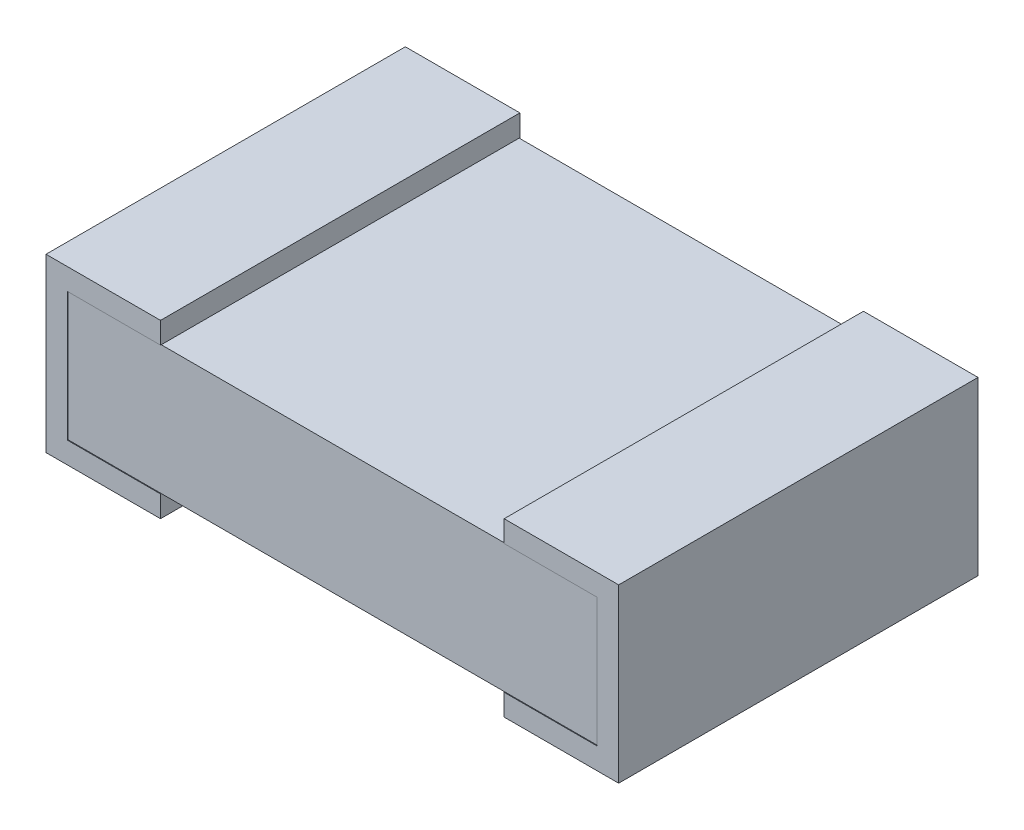
ISO-10303-21;
HEADER;
FILE_DESCRIPTION(('STEP AP214'),'2;1');
FILE_NAME('part.step','',(''),(''),'','','');
FILE_SCHEMA(('AUTOMOTIVE_DESIGN { 1 0 10303 214 1 1 1 1 }'));
ENDSEC;
DATA;
#1=APPLICATION_CONTEXT('core data for automotive mechanical design processes');
#2=APPLICATION_PROTOCOL_DEFINITION('international standard','automotive_design',2000,#1);
#3=PRODUCT_CONTEXT('',#1,'mechanical');
#4=PRODUCT('Part','Part','',(#3));
#5=PRODUCT_RELATED_PRODUCT_CATEGORY('part','',(#4));
#6=PRODUCT_DEFINITION_FORMATION('','',#4);
#7=PRODUCT_DEFINITION_CONTEXT('part definition',#1,'design');
#8=PRODUCT_DEFINITION('design','',#6,#7);
#9=PRODUCT_DEFINITION_SHAPE('','',#8);
#10=(LENGTH_UNIT() NAMED_UNIT(*) SI_UNIT(.MILLI.,.METRE.));
#11=(NAMED_UNIT(*) PLANE_ANGLE_UNIT() SI_UNIT($,.RADIAN.));
#12=(NAMED_UNIT(*) SI_UNIT($,.STERADIAN.) SOLID_ANGLE_UNIT());
#13=UNCERTAINTY_MEASURE_WITH_UNIT(LENGTH_MEASURE(1.E-05),#10,'distance_accuracy_value','');
#14=(GEOMETRIC_REPRESENTATION_CONTEXT(3) GLOBAL_UNCERTAINTY_ASSIGNED_CONTEXT((#13)) GLOBAL_UNIT_ASSIGNED_CONTEXT((#10,
#11,#12)) REPRESENTATION_CONTEXT('',''));
#15=CARTESIAN_POINT('',(0.,0.,0.));
#16=DIRECTION('',(0.,0.,1.));
#17=DIRECTION('',(1.,0.,0.));
#18=AXIS2_PLACEMENT_3D('',#15,#16,#17);
#19=CARTESIAN_POINT('',(1.9558,0.0762000000000002,-0.635));
#20=DIRECTION('',(0.,-1.,0.));
#21=DIRECTION('',(1.,0.,0.));
#22=AXIS2_PLACEMENT_3D('',#19,#20,#21);
#23=PLANE('',#22);
#24=DIRECTION('',(1.,0.,0.));
#25=VECTOR('',#24,1.);
#26=CARTESIAN_POINT('',(1.9558,0.0762000000000002,-0.635));
#27=LINE('',#26,#25);
#28=CARTESIAN_POINT('',(0.4064,0.0762000000000001,-0.635));
#29=VERTEX_POINT('',#28);
#30=CARTESIAN_POINT('',(1.6256,0.0762000000000001,-0.635));
#31=VERTEX_POINT('',#30);
#32=EDGE_CURVE('E43',#29,#31,#27,.T.);
#33=ORIENTED_EDGE('',*,*,#32,.T.);
#34=DIRECTION('',(0.,0.,-1.));
#35=VECTOR('',#34,1.);
#36=CARTESIAN_POINT('',(1.6256,0.0762000000000001,0.63754));
#37=LINE('',#36,#35);
#38=CARTESIAN_POINT('',(1.6256,0.0762000000000001,0.635));
#39=VERTEX_POINT('',#38);
#40=EDGE_CURVE('E274',#39,#31,#37,.T.);
#41=ORIENTED_EDGE('',*,*,#40,.F.);
#42=DIRECTION('',(1.,0.,0.));
#43=VECTOR('',#42,1.);
#44=CARTESIAN_POINT('',(1.9558,0.0762000000000002,0.635));
#45=LINE('',#44,#43);
#46=CARTESIAN_POINT('',(0.4064,0.0762000000000001,0.635));
#47=VERTEX_POINT('',#46);
#48=EDGE_CURVE('E373',#47,#39,#45,.T.);
#49=ORIENTED_EDGE('',*,*,#48,.F.);
#50=DIRECTION('',(0.,0.,-1.));
#51=VECTOR('',#50,1.);
#52=CARTESIAN_POINT('',(0.4064,0.0762000000000001,0.63754));
#53=LINE('',#52,#51);
#54=EDGE_CURVE('E335',#47,#29,#53,.T.);
#55=ORIENTED_EDGE('',*,*,#54,.T.);
#56=EDGE_LOOP('',(#33,#41,#49,#55));
#57=FACE_BOUND('',#56,.T.);
#58=ADVANCED_FACE('F34',(#57),#23,.T.);
#59=CARTESIAN_POINT('',(0.0762,0.5334,-0.635));
#60=DIRECTION('',(0.,1.,0.));
#61=DIRECTION('',(-1.,0.,0.));
#62=AXIS2_PLACEMENT_3D('',#59,#60,#61);
#63=PLANE('',#62);
#64=DIRECTION('',(-1.,0.,0.));
#65=VECTOR('',#64,1.);
#66=CARTESIAN_POINT('',(0.0762,0.5334,0.635));
#67=LINE('',#66,#65);
#68=CARTESIAN_POINT('',(1.6256,0.5334,0.635));
#69=VERTEX_POINT('',#68);
#70=CARTESIAN_POINT('',(0.4064,0.5334,0.635));
#71=VERTEX_POINT('',#70);
#72=EDGE_CURVE('E366',#69,#71,#67,.T.);
#73=ORIENTED_EDGE('',*,*,#72,.F.);
#74=DIRECTION('',(0.,0.,-1.));
#75=VECTOR('',#74,1.);
#76=CARTESIAN_POINT('',(1.6256,0.5334,0.63754));
#77=LINE('',#76,#75);
#78=CARTESIAN_POINT('',(1.6256,0.5334,-0.635));
#79=VERTEX_POINT('',#78);
#80=EDGE_CURVE('E263',#69,#79,#77,.T.);
#81=ORIENTED_EDGE('',*,*,#80,.T.);
#82=DIRECTION('',(-1.,0.,0.));
#83=VECTOR('',#82,1.);
#84=CARTESIAN_POINT('',(0.0762,0.5334,-0.635));
#85=LINE('',#84,#83);
#86=CARTESIAN_POINT('',(0.4064,0.5334,-0.635));
#87=VERTEX_POINT('',#86);
#88=EDGE_CURVE('E355',#79,#87,#85,.T.);
#89=ORIENTED_EDGE('',*,*,#88,.T.);
#90=DIRECTION('',(0.,0.,-1.));
#91=VECTOR('',#90,1.);
#92=CARTESIAN_POINT('',(0.4064,0.5334,0.63754));
#93=LINE('',#92,#91);
#94=EDGE_CURVE('E346',#71,#87,#93,.T.);
#95=ORIENTED_EDGE('',*,*,#94,.F.);
#96=EDGE_LOOP('',(#73,#81,#89,#95));
#97=FACE_BOUND('',#96,.T.);
#98=ADVANCED_FACE('F36',(#97),#63,.T.);
#99=CARTESIAN_POINT('',(1.9558,0.5334,-0.635));
#100=DIRECTION('',(0.,0.,-1.));
#101=DIRECTION('',(-1.,0.,0.));
#102=AXIS2_PLACEMENT_3D('',#99,#100,#101);
#103=PLANE('',#102);
#104=DIRECTION('',(0.,1.,0.));
#105=VECTOR('',#104,1.);
#106=CARTESIAN_POINT('',(1.9558,0.0762000000000002,-0.635));
#107=LINE('',#106,#105);
#108=CARTESIAN_POINT('',(1.9558,0.0762,-0.635));
#109=VERTEX_POINT('',#108);
#110=CARTESIAN_POINT('',(1.9558,0.5334,-0.635));
#111=VERTEX_POINT('',#110);
#112=EDGE_CURVE('E353',#109,#111,#107,.T.);
#113=ORIENTED_EDGE('',*,*,#112,.F.);
#114=DIRECTION('',(-1.,0.,0.));
#115=VECTOR('',#114,1.);
#116=CARTESIAN_POINT('',(1.9558,0.0762,-0.635));
#117=LINE('',#116,#115);
#118=EDGE_CURVE('E256',#109,#31,#117,.T.);
#119=ORIENTED_EDGE('',*,*,#118,.T.);
#120=ORIENTED_EDGE('',*,*,#32,.F.);
#121=CARTESIAN_POINT('',(0.0762,0.0762,-0.635));
#122=VERTEX_POINT('',#121);
#123=EDGE_CURVE('E11',#122,#29,#27,.T.);
#124=ORIENTED_EDGE('',*,*,#123,.F.);
#125=DIRECTION('',(0.,-1.,0.));
#126=VECTOR('',#125,1.);
#127=CARTESIAN_POINT('',(0.0762,0.5334,-0.635));
#128=LINE('',#127,#126);
#129=CARTESIAN_POINT('',(0.0762,0.5334,-0.635));
#130=VERTEX_POINT('',#129);
#131=EDGE_CURVE('E358',#130,#122,#128,.T.);
#132=ORIENTED_EDGE('',*,*,#131,.F.);
#133=DIRECTION('',(-1.,0.,0.));
#134=VECTOR('',#133,1.);
#135=CARTESIAN_POINT('',(1.9558,0.5334,-0.635));
#136=LINE('',#135,#134);
#137=EDGE_CURVE('E329',#87,#130,#136,.T.);
#138=ORIENTED_EDGE('',*,*,#137,.F.);
#139=ORIENTED_EDGE('',*,*,#88,.F.);
#140=EDGE_CURVE('E356',#111,#79,#85,.T.);
#141=ORIENTED_EDGE('',*,*,#140,.F.);
#142=EDGE_LOOP('',(#113,#119,#120,#124,#132,#138,#139,#141));
#143=FACE_BOUND('',#142,.T.);
#144=ADVANCED_FACE('F437',(#143),#103,.T.);
#145=CARTESIAN_POINT('',(1.9558,0.5334,0.635));
#146=DIRECTION('',(0.,0.,-1.));
#147=DIRECTION('',(-1.,0.,0.));
#148=AXIS2_PLACEMENT_3D('',#145,#146,#147);
#149=PLANE('',#148);
#150=DIRECTION('',(0.,1.,0.));
#151=VECTOR('',#150,1.);
#152=CARTESIAN_POINT('',(1.9558,0.0762000000000002,0.635));
#153=LINE('',#152,#151);
#154=CARTESIAN_POINT('',(1.9558,0.0762000000000002,0.635));
#155=VERTEX_POINT('',#154);
#156=CARTESIAN_POINT('',(1.9558,0.5334,0.635));
#157=VERTEX_POINT('',#156);
#158=EDGE_CURVE('E352',#155,#157,#153,.T.);
#159=ORIENTED_EDGE('',*,*,#158,.T.);
#160=EDGE_CURVE('E363',#157,#69,#67,.T.);
#161=ORIENTED_EDGE('',*,*,#160,.T.);
#162=ORIENTED_EDGE('',*,*,#72,.T.);
#163=CARTESIAN_POINT('',(0.0762,0.5334,0.635));
#164=VERTEX_POINT('',#163);
#165=EDGE_CURVE('E362',#71,#164,#67,.T.);
#166=ORIENTED_EDGE('',*,*,#165,.T.);
#167=DIRECTION('',(0.,-1.,0.));
#168=VECTOR('',#167,1.);
#169=CARTESIAN_POINT('',(0.0762,0.5334,0.635));
#170=LINE('',#169,#168);
#171=CARTESIAN_POINT('',(0.0762,0.0762,0.635));
#172=VERTEX_POINT('',#171);
#173=EDGE_CURVE('E365',#164,#172,#170,.T.);
#174=ORIENTED_EDGE('',*,*,#173,.T.);
#175=EDGE_CURVE('E38',#172,#47,#45,.T.);
#176=ORIENTED_EDGE('',*,*,#175,.T.);
#177=ORIENTED_EDGE('',*,*,#48,.T.);
#178=EDGE_CURVE('E368',#39,#155,#45,.T.);
#179=ORIENTED_EDGE('',*,*,#178,.T.);
#180=EDGE_LOOP('',(#159,#161,#162,#166,#174,#176,#177,#179));
#181=FACE_BOUND('',#180,.T.);
#182=ADVANCED_FACE('F375',(#181),#149,.F.);
#183=CARTESIAN_POINT('',(0.0762,0.0762,0.63754));
#184=DIRECTION('',(0.,1.,0.));
#185=DIRECTION('',(-1.,0.,0.));
#186=AXIS2_PLACEMENT_3D('',#183,#184,#185);
#187=PLANE('',#186);
#188=ORIENTED_EDGE('',*,*,#175,.F.);
#189=DIRECTION('',(0.,0.,-1.));
#190=VECTOR('',#189,1.);
#191=CARTESIAN_POINT('',(0.0762,0.0762,0.63754));
#192=LINE('',#191,#190);
#193=CARTESIAN_POINT('',(0.0762,0.0762,0.63754));
#194=VERTEX_POINT('',#193);
#195=EDGE_CURVE('E337',#194,#172,#192,.T.);
#196=ORIENTED_EDGE('',*,*,#195,.F.);
#197=DIRECTION('',(1.,0.,0.));
#198=VECTOR('',#197,1.);
#199=CARTESIAN_POINT('',(0.0762,0.0762,0.63754));
#200=LINE('',#199,#198);
#201=CARTESIAN_POINT('',(0.4064,0.0762000000000001,0.63754));
#202=VERTEX_POINT('',#201);
#203=EDGE_CURVE('E295',#194,#202,#200,.T.);
#204=ORIENTED_EDGE('',*,*,#203,.T.);
#205=EDGE_CURVE('E332',#202,#47,#53,.T.);
#206=ORIENTED_EDGE('',*,*,#205,.T.);
#207=EDGE_LOOP('',(#188,#196,#204,#206));
#208=FACE_BOUND('',#207,.T.);
#209=ADVANCED_FACE('F378',(#208),#187,.T.);
#210=CARTESIAN_POINT('',(0.0762,0.5334,0.63754));
#211=DIRECTION('',(1.,0.,0.));
#212=DIRECTION('',(0.,0.,-1.));
#213=AXIS2_PLACEMENT_3D('',#210,#211,#212);
#214=PLANE('',#213);
#215=ORIENTED_EDGE('',*,*,#173,.F.);
#216=DIRECTION('',(0.,0.,-1.));
#217=VECTOR('',#216,1.);
#218=CARTESIAN_POINT('',(0.0762,0.5334,0.63754));
#219=LINE('',#218,#217);
#220=CARTESIAN_POINT('',(0.0762,0.5334,0.63754));
#221=VERTEX_POINT('',#220);
#222=EDGE_CURVE('E59',#221,#164,#219,.T.);
#223=ORIENTED_EDGE('',*,*,#222,.F.);
#224=DIRECTION('',(0.,-1.,0.));
#225=VECTOR('',#224,1.);
#226=CARTESIAN_POINT('',(0.0762,0.5334,0.63754));
#227=LINE('',#226,#225);
#228=EDGE_CURVE('E292',#221,#194,#227,.T.);
#229=ORIENTED_EDGE('',*,*,#228,.T.);
#230=ORIENTED_EDGE('',*,*,#195,.T.);
#231=EDGE_LOOP('',(#215,#223,#229,#230));
#232=FACE_BOUND('',#231,.T.);
#233=ADVANCED_FACE('F381',(#232),#214,.T.);
#234=CARTESIAN_POINT('',(0.4064,0.5334,0.63754));
#235=DIRECTION('',(0.,-1.,0.));
#236=DIRECTION('',(0.,0.,-1.));
#237=AXIS2_PLACEMENT_3D('',#234,#235,#236);
#238=PLANE('',#237);
#239=ORIENTED_EDGE('',*,*,#165,.F.);
#240=CARTESIAN_POINT('',(0.4064,0.5334,0.63754));
#241=VERTEX_POINT('',#240);
#242=EDGE_CURVE('E343',#241,#71,#93,.T.);
#243=ORIENTED_EDGE('',*,*,#242,.F.);
#244=DIRECTION('',(-1.,0.,0.));
#245=VECTOR('',#244,1.);
#246=CARTESIAN_POINT('',(0.4064,0.5334,0.63754));
#247=LINE('',#246,#245);
#248=EDGE_CURVE('E290',#241,#221,#247,.T.);
#249=ORIENTED_EDGE('',*,*,#248,.T.);
#250=ORIENTED_EDGE('',*,*,#222,.T.);
#251=EDGE_LOOP('',(#239,#243,#249,#250));
#252=FACE_BOUND('',#251,.T.);
#253=ADVANCED_FACE('F389',(#252),#238,.T.);
#254=CARTESIAN_POINT('',(0.,0.,0.63754));
#255=DIRECTION('',(-1.,0.,0.));
#256=DIRECTION('',(0.,0.,1.));
#257=AXIS2_PLACEMENT_3D('',#254,#255,#256);
#258=PLANE('',#257);
#259=DIRECTION('',(0.,1.,0.));
#260=VECTOR('',#259,1.);
#261=CARTESIAN_POINT('',(0.,0.,-0.63754));
#262=LINE('',#261,#260);
#263=CARTESIAN_POINT('',(0.,0.,-0.63754));
#264=VERTEX_POINT('',#263);
#265=CARTESIAN_POINT('',(0.,0.6096,-0.63754));
#266=VERTEX_POINT('',#265);
#267=EDGE_CURVE('E279',#264,#266,#262,.T.);
#268=ORIENTED_EDGE('',*,*,#267,.F.);
#269=DIRECTION('',(0.,0.,-1.));
#270=VECTOR('',#269,1.);
#271=CARTESIAN_POINT('',(0.,0.,0.63754));
#272=LINE('',#271,#270);
#273=CARTESIAN_POINT('',(0.,0.,0.63754));
#274=VERTEX_POINT('',#273);
#275=EDGE_CURVE('E327',#274,#264,#272,.T.);
#276=ORIENTED_EDGE('',*,*,#275,.F.);
#277=DIRECTION('',(0.,1.,0.));
#278=VECTOR('',#277,1.);
#279=CARTESIAN_POINT('',(0.,0.,0.63754));
#280=LINE('',#279,#278);
#281=CARTESIAN_POINT('',(0.,0.6096,0.63754));
#282=VERTEX_POINT('',#281);
#283=EDGE_CURVE('E280',#274,#282,#280,.T.);
#284=ORIENTED_EDGE('',*,*,#283,.T.);
#285=DIRECTION('',(0.,0.,-1.));
#286=VECTOR('',#285,1.);
#287=CARTESIAN_POINT('',(0.,0.6096,0.63754));
#288=LINE('',#287,#286);
#289=EDGE_CURVE('E304',#282,#266,#288,.T.);
#290=ORIENTED_EDGE('',*,*,#289,.T.);
#291=EDGE_LOOP('',(#268,#276,#284,#290));
#292=FACE_BOUND('',#291,.T.);
#293=ADVANCED_FACE('F415',(#292),#258,.T.);
#294=CARTESIAN_POINT('',(0.,0.,0.63754));
#295=DIRECTION('',(0.,-1.,0.));
#296=DIRECTION('',(1.,0.,0.));
#297=AXIS2_PLACEMENT_3D('',#294,#295,#296);
#298=PLANE('',#297);
#299=DIRECTION('',(-1.,0.,0.));
#300=VECTOR('',#299,1.);
#301=CARTESIAN_POINT('',(0.,0.,-0.63754));
#302=LINE('',#301,#300);
#303=CARTESIAN_POINT('',(0.4064,0.,-0.63754));
#304=VERTEX_POINT('',#303);
#305=EDGE_CURVE('E284',#304,#264,#302,.T.);
#306=ORIENTED_EDGE('',*,*,#305,.F.);
#307=DIRECTION('',(0.,0.,-1.));
#308=VECTOR('',#307,1.);
#309=CARTESIAN_POINT('',(0.4064,0.,0.63754));
#310=LINE('',#309,#308);
#311=CARTESIAN_POINT('',(0.4064,0.,0.63754));
#312=VERTEX_POINT('',#311);
#313=EDGE_CURVE('E330',#312,#304,#310,.T.);
#314=ORIENTED_EDGE('',*,*,#313,.F.);
#315=DIRECTION('',(-1.,0.,0.));
#316=VECTOR('',#315,1.);
#317=CARTESIAN_POINT('',(0.,0.,0.63754));
#318=LINE('',#317,#316);
#319=EDGE_CURVE('E301',#312,#274,#318,.T.);
#320=ORIENTED_EDGE('',*,*,#319,.T.);
#321=ORIENTED_EDGE('',*,*,#275,.T.);
#322=EDGE_LOOP('',(#306,#314,#320,#321));
#323=FACE_BOUND('',#322,.T.);
#324=ADVANCED_FACE('F418',(#323),#298,.T.);
#325=CARTESIAN_POINT('',(0.4064,0.,0.63754));
#326=DIRECTION('',(1.,0.,0.));
#327=DIRECTION('',(0.,0.,-1.));
#328=AXIS2_PLACEMENT_3D('',#325,#326,#327);
#329=PLANE('',#328);
#330=DIRECTION('',(0.,-1.,0.));
#331=VECTOR('',#330,1.);
#332=CARTESIAN_POINT('',(0.4064,0.,-0.63754));
#333=LINE('',#332,#331);
#334=CARTESIAN_POINT('',(0.4064,0.0762000000000001,-0.63754));
#335=VERTEX_POINT('',#334);
#336=EDGE_CURVE('E322',#335,#304,#333,.T.);
#337=ORIENTED_EDGE('',*,*,#336,.F.);
#338=EDGE_CURVE('E336',#29,#335,#53,.T.);
#339=ORIENTED_EDGE('',*,*,#338,.F.);
#340=ORIENTED_EDGE('',*,*,#54,.F.);
#341=ORIENTED_EDGE('',*,*,#205,.F.);
#342=DIRECTION('',(0.,-1.,0.));
#343=VECTOR('',#342,1.);
#344=CARTESIAN_POINT('',(0.4064,0.,0.63754));
#345=LINE('',#344,#343);
#346=EDGE_CURVE('E298',#202,#312,#345,.T.);
#347=ORIENTED_EDGE('',*,*,#346,.T.);
#348=ORIENTED_EDGE('',*,*,#313,.T.);
#349=EDGE_LOOP('',(#337,#339,#340,#341,#347,#348));
#350=FACE_BOUND('',#349,.T.);
#351=ADVANCED_FACE('F421',(#350),#329,.T.);
#352=CARTESIAN_POINT('',(0.0762,0.0762,-0.63754));
#353=VERTEX_POINT('',#352);
#354=EDGE_CURVE('E340',#122,#353,#192,.T.);
#355=ORIENTED_EDGE('',*,*,#354,.F.);
#356=ORIENTED_EDGE('',*,*,#123,.T.);
#357=ORIENTED_EDGE('',*,*,#338,.T.);
#358=DIRECTION('',(1.,0.,0.));
#359=VECTOR('',#358,1.);
#360=CARTESIAN_POINT('',(0.0762,0.0762,-0.63754));
#361=LINE('',#360,#359);
#362=EDGE_CURVE('E319',#353,#335,#361,.T.);
#363=ORIENTED_EDGE('',*,*,#362,.F.);
#364=EDGE_LOOP('',(#355,#356,#357,#363));
#365=FACE_BOUND('',#364,.T.);
#366=ADVANCED_FACE('F430',(#365),#187,.T.);
#367=CARTESIAN_POINT('',(0.0762,0.5334,-0.63754));
#368=VERTEX_POINT('',#367);
#369=EDGE_CURVE('E342',#130,#368,#219,.T.);
#370=ORIENTED_EDGE('',*,*,#369,.F.);
#371=ORIENTED_EDGE('',*,*,#131,.T.);
#372=ORIENTED_EDGE('',*,*,#354,.T.);
#373=DIRECTION('',(0.,-1.,0.));
#374=VECTOR('',#373,1.);
#375=CARTESIAN_POINT('',(0.0762,0.5334,-0.63754));
#376=LINE('',#375,#374);
#377=EDGE_CURVE('E316',#368,#353,#376,.T.);
#378=ORIENTED_EDGE('',*,*,#377,.F.);
#379=EDGE_LOOP('',(#370,#371,#372,#378));
#380=FACE_BOUND('',#379,.T.);
#381=ADVANCED_FACE('F433',(#380),#214,.T.);
#382=CARTESIAN_POINT('',(0.4064,0.5334,-0.63754));
#383=VERTEX_POINT('',#382);
#384=EDGE_CURVE('E347',#87,#383,#93,.T.);
#385=ORIENTED_EDGE('',*,*,#384,.F.);
#386=ORIENTED_EDGE('',*,*,#137,.T.);
#387=ORIENTED_EDGE('',*,*,#369,.T.);
#388=DIRECTION('',(-1.,0.,0.));
#389=VECTOR('',#388,1.);
#390=CARTESIAN_POINT('',(0.4064,0.5334,-0.63754));
#391=LINE('',#390,#389);
#392=EDGE_CURVE('E313',#383,#368,#391,.T.);
#393=ORIENTED_EDGE('',*,*,#392,.F.);
#394=EDGE_LOOP('',(#385,#386,#387,#393));
#395=FACE_BOUND('',#394,.T.);
#396=ADVANCED_FACE('F403',(#395),#238,.T.);
#397=CARTESIAN_POINT('',(0.4064,0.6096,0.63754));
#398=DIRECTION('',(1.,0.,0.));
#399=DIRECTION('',(0.,1.,0.));
#400=AXIS2_PLACEMENT_3D('',#397,#398,#399);
#401=PLANE('',#400);
#402=DIRECTION('',(0.,-1.,0.));
#403=VECTOR('',#402,1.);
#404=CARTESIAN_POINT('',(0.4064,0.6096,-0.63754));
#405=LINE('',#404,#403);
#406=CARTESIAN_POINT('',(0.4064,0.6096,-0.63754));
#407=VERTEX_POINT('',#406);
#408=EDGE_CURVE('E310',#407,#383,#405,.T.);
#409=ORIENTED_EDGE('',*,*,#408,.F.);
#410=DIRECTION('',(0.,0.,-1.));
#411=VECTOR('',#410,1.);
#412=CARTESIAN_POINT('',(0.4064,0.6096,0.63754));
#413=LINE('',#412,#411);
#414=CARTESIAN_POINT('',(0.4064,0.6096,0.63754));
#415=VERTEX_POINT('',#414);
#416=EDGE_CURVE('E348',#415,#407,#413,.T.);
#417=ORIENTED_EDGE('',*,*,#416,.F.);
#418=DIRECTION('',(0.,-1.,0.));
#419=VECTOR('',#418,1.);
#420=CARTESIAN_POINT('',(0.4064,0.6096,0.63754));
#421=LINE('',#420,#419);
#422=EDGE_CURVE('E287',#415,#241,#421,.T.);
#423=ORIENTED_EDGE('',*,*,#422,.T.);
#424=ORIENTED_EDGE('',*,*,#242,.T.);
#425=ORIENTED_EDGE('',*,*,#94,.T.);
#426=ORIENTED_EDGE('',*,*,#384,.T.);
#427=EDGE_LOOP('',(#409,#417,#423,#424,#425,#426));
#428=FACE_BOUND('',#427,.T.);
#429=ADVANCED_FACE('F394',(#428),#401,.T.);
#430=CARTESIAN_POINT('',(0.,0.6096,0.63754));
#431=DIRECTION('',(0.,1.,0.));
#432=DIRECTION('',(0.,0.,1.));
#433=AXIS2_PLACEMENT_3D('',#430,#431,#432);
#434=PLANE('',#433);
#435=DIRECTION('',(1.,0.,0.));
#436=VECTOR('',#435,1.);
#437=CARTESIAN_POINT('',(0.,0.6096,-0.63754));
#438=LINE('',#437,#436);
#439=EDGE_CURVE('E307',#266,#407,#438,.T.);
#440=ORIENTED_EDGE('',*,*,#439,.F.);
#441=ORIENTED_EDGE('',*,*,#289,.F.);
#442=DIRECTION('',(1.,0.,0.));
#443=VECTOR('',#442,1.);
#444=CARTESIAN_POINT('',(0.,0.6096,0.63754));
#445=LINE('',#444,#443);
#446=EDGE_CURVE('E283',#282,#415,#445,.T.);
#447=ORIENTED_EDGE('',*,*,#446,.T.);
#448=ORIENTED_EDGE('',*,*,#416,.T.);
#449=EDGE_LOOP('',(#440,#441,#447,#448));
#450=FACE_BOUND('',#449,.T.);
#451=ADVANCED_FACE('F411',(#450),#434,.T.);
#452=CARTESIAN_POINT('',(0.,0.6096,0.63754));
#453=DIRECTION('',(0.,0.,-1.));
#454=DIRECTION('',(-1.,0.,0.));
#455=AXIS2_PLACEMENT_3D('',#452,#453,#454);
#456=PLANE('',#455);
#457=ORIENTED_EDGE('',*,*,#283,.F.);
#458=ORIENTED_EDGE('',*,*,#319,.F.);
#459=ORIENTED_EDGE('',*,*,#346,.F.);
#460=ORIENTED_EDGE('',*,*,#203,.F.);
#461=ORIENTED_EDGE('',*,*,#228,.F.);
#462=ORIENTED_EDGE('',*,*,#248,.F.);
#463=ORIENTED_EDGE('',*,*,#422,.F.);
#464=ORIENTED_EDGE('',*,*,#446,.F.);
#465=EDGE_LOOP('',(#457,#458,#459,#460,#461,#462,#463,#464));
#466=FACE_BOUND('',#465,.T.);
#467=ADVANCED_FACE('F386',(#466),#456,.F.);
#468=CARTESIAN_POINT('',(0.,0.6096,-0.63754));
#469=DIRECTION('',(0.,0.,-1.));
#470=DIRECTION('',(-1.,0.,0.));
#471=AXIS2_PLACEMENT_3D('',#468,#469,#470);
#472=PLANE('',#471);
#473=ORIENTED_EDGE('',*,*,#267,.T.);
#474=ORIENTED_EDGE('',*,*,#439,.T.);
#475=ORIENTED_EDGE('',*,*,#408,.T.);
#476=ORIENTED_EDGE('',*,*,#392,.T.);
#477=ORIENTED_EDGE('',*,*,#377,.T.);
#478=ORIENTED_EDGE('',*,*,#362,.T.);
#479=ORIENTED_EDGE('',*,*,#336,.T.);
#480=ORIENTED_EDGE('',*,*,#305,.T.);
#481=EDGE_LOOP('',(#473,#474,#475,#476,#477,#478,#479,#480));
#482=FACE_BOUND('',#481,.T.);
#483=ADVANCED_FACE('F407',(#482),#472,.T.);
#484=CARTESIAN_POINT('',(1.6256,0.5334,0.63754));
#485=DIRECTION('',(0.,1.,0.));
#486=DIRECTION('',(0.,0.,1.));
#487=AXIS2_PLACEMENT_3D('',#484,#485,#486);
#488=PLANE('',#487);
#489=CARTESIAN_POINT('',(1.6256,0.5334,0.63754));
#490=VERTEX_POINT('',#489);
#491=EDGE_CURVE('E260',#490,#69,#77,.T.);
#492=ORIENTED_EDGE('',*,*,#491,.T.);
#493=ORIENTED_EDGE('',*,*,#160,.F.);
#494=DIRECTION('',(0.,0.,-1.));
#495=VECTOR('',#494,1.);
#496=CARTESIAN_POINT('',(1.9558,0.5334,0.63754));
#497=LINE('',#496,#495);
#498=CARTESIAN_POINT('',(1.9558,0.5334,0.63754));
#499=VERTEX_POINT('',#498);
#500=EDGE_CURVE('E265',#499,#157,#497,.T.);
#501=ORIENTED_EDGE('',*,*,#500,.F.);
#502=DIRECTION('',(1.,0.,0.));
#503=VECTOR('',#502,1.);
#504=CARTESIAN_POINT('',(1.6256,0.5334,0.63754));
#505=LINE('',#504,#503);
#506=EDGE_CURVE('E234',#490,#499,#505,.T.);
#507=ORIENTED_EDGE('',*,*,#506,.F.);
#508=EDGE_LOOP('',(#492,#493,#501,#507));
#509=FACE_BOUND('',#508,.T.);
#510=ADVANCED_FACE('F463',(#509),#488,.F.);
#511=CARTESIAN_POINT('',(1.9558,0.5334,0.63754));
#512=DIRECTION('',(1.,0.,0.));
#513=DIRECTION('',(0.,0.,-1.));
#514=AXIS2_PLACEMENT_3D('',#511,#512,#513);
#515=PLANE('',#514);
#516=ORIENTED_EDGE('',*,*,#500,.T.);
#517=ORIENTED_EDGE('',*,*,#158,.F.);
#518=DIRECTION('',(0.,0.,-1.));
#519=VECTOR('',#518,1.);
#520=CARTESIAN_POINT('',(1.9558,0.0762,0.63754));
#521=LINE('',#520,#519);
#522=CARTESIAN_POINT('',(1.9558,0.0762,0.63754));
#523=VERTEX_POINT('',#522);
#524=EDGE_CURVE('E51',#523,#155,#521,.T.);
#525=ORIENTED_EDGE('',*,*,#524,.F.);
#526=DIRECTION('',(0.,-1.,0.));
#527=VECTOR('',#526,1.);
#528=CARTESIAN_POINT('',(1.9558,0.5334,0.63754));
#529=LINE('',#528,#527);
#530=EDGE_CURVE('E232',#499,#523,#529,.T.);
#531=ORIENTED_EDGE('',*,*,#530,.F.);
#532=EDGE_LOOP('',(#516,#517,#525,#531));
#533=FACE_BOUND('',#532,.T.);
#534=ADVANCED_FACE('F466',(#533),#515,.F.);
#535=CARTESIAN_POINT('',(1.9558,0.0762,0.63754));
#536=DIRECTION('',(0.,-1.,0.));
#537=DIRECTION('',(1.,0.,0.));
#538=AXIS2_PLACEMENT_3D('',#535,#536,#537);
#539=PLANE('',#538);
#540=ORIENTED_EDGE('',*,*,#524,.T.);
#541=ORIENTED_EDGE('',*,*,#178,.F.);
#542=CARTESIAN_POINT('',(1.6256,0.0762000000000001,0.63754));
#543=VERTEX_POINT('',#542);
#544=EDGE_CURVE('E271',#543,#39,#37,.T.);
#545=ORIENTED_EDGE('',*,*,#544,.F.);
#546=DIRECTION('',(-1.,0.,0.));
#547=VECTOR('',#546,1.);
#548=CARTESIAN_POINT('',(1.9558,0.0762,0.63754));
#549=LINE('',#548,#547);
#550=EDGE_CURVE('E230',#523,#543,#549,.T.);
#551=ORIENTED_EDGE('',*,*,#550,.F.);
#552=EDGE_LOOP('',(#540,#541,#545,#551));
#553=FACE_BOUND('',#552,.T.);
#554=ADVANCED_FACE('F468',(#553),#539,.F.);
#555=CARTESIAN_POINT('',(2.032,0.,0.63754));
#556=DIRECTION('',(-1.,0.,0.));
#557=DIRECTION('',(0.,0.,1.));
#558=AXIS2_PLACEMENT_3D('',#555,#556,#557);
#559=PLANE('',#558);
#560=DIRECTION('',(0.,1.,0.));
#561=VECTOR('',#560,1.);
#562=CARTESIAN_POINT('',(2.032,0.,-0.63754));
#563=LINE('',#562,#561);
#564=CARTESIAN_POINT('',(2.032,0.,-0.63754));
#565=VERTEX_POINT('',#564);
#566=CARTESIAN_POINT('',(2.032,0.6096,-0.63754));
#567=VERTEX_POINT('',#566);
#568=EDGE_CURVE('E239',#565,#567,#563,.T.);
#569=ORIENTED_EDGE('',*,*,#568,.T.);
#570=DIRECTION('',(0.,0.,-1.));
#571=VECTOR('',#570,1.);
#572=CARTESIAN_POINT('',(2.032,0.6096,0.63754));
#573=LINE('',#572,#571);
#574=CARTESIAN_POINT('',(2.032,0.6096,0.63754));
#575=VERTEX_POINT('',#574);
#576=EDGE_CURVE('E223',#575,#567,#573,.T.);
#577=ORIENTED_EDGE('',*,*,#576,.F.);
#578=DIRECTION('',(0.,1.,0.));
#579=VECTOR('',#578,1.);
#580=CARTESIAN_POINT('',(2.032,0.,0.63754));
#581=LINE('',#580,#579);
#582=CARTESIAN_POINT('',(2.032,0.,0.63754));
#583=VERTEX_POINT('',#582);
#584=EDGE_CURVE('E202',#583,#575,#581,.T.);
#585=ORIENTED_EDGE('',*,*,#584,.F.);
#586=DIRECTION('',(0.,0.,-1.));
#587=VECTOR('',#586,1.);
#588=CARTESIAN_POINT('',(2.032,0.,0.63754));
#589=LINE('',#588,#587);
#590=EDGE_CURVE('E211',#583,#565,#589,.T.);
#591=ORIENTED_EDGE('',*,*,#590,.T.);
#592=EDGE_LOOP('',(#569,#577,#585,#591));
#593=FACE_BOUND('',#592,.T.);
#594=ADVANCED_FACE('F221',(#593),#559,.F.);
#595=CARTESIAN_POINT('',(2.032,0.6096,0.63754));
#596=DIRECTION('',(0.,-1.,0.));
#597=DIRECTION('',(0.,0.,-1.));
#598=AXIS2_PLACEMENT_3D('',#595,#596,#597);
#599=PLANE('',#598);
#600=DIRECTION('',(-1.,0.,0.));
#601=VECTOR('',#600,1.);
#602=CARTESIAN_POINT('',(2.032,0.6096,-0.63754));
#603=LINE('',#602,#601);
#604=CARTESIAN_POINT('',(1.6256,0.6096,-0.63754));
#605=VERTEX_POINT('',#604);
#606=EDGE_CURVE('E224',#567,#605,#603,.T.);
#607=ORIENTED_EDGE('',*,*,#606,.T.);
#608=DIRECTION('',(0.,0.,-1.));
#609=VECTOR('',#608,1.);
#610=CARTESIAN_POINT('',(1.6256,0.6096,0.63754));
#611=LINE('',#610,#609);
#612=CARTESIAN_POINT('',(1.6256,0.6096,0.63754));
#613=VERTEX_POINT('',#612);
#614=EDGE_CURVE('E257',#613,#605,#611,.T.);
#615=ORIENTED_EDGE('',*,*,#614,.F.);
#616=DIRECTION('',(-1.,0.,0.));
#617=VECTOR('',#616,1.);
#618=CARTESIAN_POINT('',(2.032,0.6096,0.63754));
#619=LINE('',#618,#617);
#620=EDGE_CURVE('E219',#575,#613,#619,.T.);
#621=ORIENTED_EDGE('',*,*,#620,.F.);
#622=ORIENTED_EDGE('',*,*,#576,.T.);
#623=EDGE_LOOP('',(#607,#615,#621,#622));
#624=FACE_BOUND('',#623,.T.);
#625=ADVANCED_FACE('F454',(#624),#599,.F.);
#626=CARTESIAN_POINT('',(1.6256,0.6096,0.63754));
#627=DIRECTION('',(1.,0.,0.));
#628=DIRECTION('',(0.,1.,0.));
#629=AXIS2_PLACEMENT_3D('',#626,#627,#628);
#630=PLANE('',#629);
#631=DIRECTION('',(0.,-1.,0.));
#632=VECTOR('',#631,1.);
#633=CARTESIAN_POINT('',(1.6256,0.6096,-0.63754));
#634=LINE('',#633,#632);
#635=CARTESIAN_POINT('',(1.6256,0.5334,-0.63754));
#636=VERTEX_POINT('',#635);
#637=EDGE_CURVE('E226',#605,#636,#634,.T.);
#638=ORIENTED_EDGE('',*,*,#637,.T.);
#639=EDGE_CURVE('E264',#79,#636,#77,.T.);
#640=ORIENTED_EDGE('',*,*,#639,.F.);
#641=ORIENTED_EDGE('',*,*,#80,.F.);
#642=ORIENTED_EDGE('',*,*,#491,.F.);
#643=DIRECTION('',(0.,-1.,0.));
#644=VECTOR('',#643,1.);
#645=CARTESIAN_POINT('',(1.6256,0.6096,0.63754));
#646=LINE('',#645,#644);
#647=EDGE_CURVE('E236',#613,#490,#646,.T.);
#648=ORIENTED_EDGE('',*,*,#647,.F.);
#649=ORIENTED_EDGE('',*,*,#614,.T.);
#650=EDGE_LOOP('',(#638,#640,#641,#642,#648,#649));
#651=FACE_BOUND('',#650,.T.);
#652=ADVANCED_FACE('F460',(#651),#630,.F.);
#653=ORIENTED_EDGE('',*,*,#140,.T.);
#654=ORIENTED_EDGE('',*,*,#639,.T.);
#655=DIRECTION('',(1.,0.,0.));
#656=VECTOR('',#655,1.);
#657=CARTESIAN_POINT('',(1.6256,0.5334,-0.63754));
#658=LINE('',#657,#656);
#659=CARTESIAN_POINT('',(1.9558,0.5334,-0.63754));
#660=VERTEX_POINT('',#659);
#661=EDGE_CURVE('E250',#636,#660,#658,.T.);
#662=ORIENTED_EDGE('',*,*,#661,.T.);
#663=EDGE_CURVE('E268',#111,#660,#497,.T.);
#664=ORIENTED_EDGE('',*,*,#663,.F.);
#665=EDGE_LOOP('',(#653,#654,#662,#664));
#666=FACE_BOUND('',#665,.T.);
#667=ADVANCED_FACE('F551',(#666),#488,.F.);
#668=ORIENTED_EDGE('',*,*,#112,.T.);
#669=ORIENTED_EDGE('',*,*,#663,.T.);
#670=DIRECTION('',(0.,-1.,0.));
#671=VECTOR('',#670,1.);
#672=CARTESIAN_POINT('',(1.9558,0.5334,-0.63754));
#673=LINE('',#672,#671);
#674=CARTESIAN_POINT('',(1.9558,0.0762,-0.63754));
#675=VERTEX_POINT('',#674);
#676=EDGE_CURVE('E247',#660,#675,#673,.T.);
#677=ORIENTED_EDGE('',*,*,#676,.T.);
#678=EDGE_CURVE('E270',#109,#675,#521,.T.);
#679=ORIENTED_EDGE('',*,*,#678,.F.);
#680=EDGE_LOOP('',(#668,#669,#677,#679));
#681=FACE_BOUND('',#680,.T.);
#682=ADVANCED_FACE('F477',(#681),#515,.F.);
#683=ORIENTED_EDGE('',*,*,#118,.F.);
#684=ORIENTED_EDGE('',*,*,#678,.T.);
#685=DIRECTION('',(-1.,0.,0.));
#686=VECTOR('',#685,1.);
#687=CARTESIAN_POINT('',(1.9558,0.0762,-0.63754));
#688=LINE('',#687,#686);
#689=CARTESIAN_POINT('',(1.6256,0.0762000000000001,-0.63754));
#690=VERTEX_POINT('',#689);
#691=EDGE_CURVE('E244',#675,#690,#688,.T.);
#692=ORIENTED_EDGE('',*,*,#691,.T.);
#693=EDGE_CURVE('E275',#31,#690,#37,.T.);
#694=ORIENTED_EDGE('',*,*,#693,.F.);
#695=EDGE_LOOP('',(#683,#684,#692,#694));
#696=FACE_BOUND('',#695,.T.);
#697=ADVANCED_FACE('F445',(#696),#539,.F.);
#698=CARTESIAN_POINT('',(1.6256,0.,0.63754));
#699=DIRECTION('',(1.,0.,0.));
#700=DIRECTION('',(0.,0.,-1.));
#701=AXIS2_PLACEMENT_3D('',#698,#699,#700);
#702=PLANE('',#701);
#703=DIRECTION('',(0.,-1.,0.));
#704=VECTOR('',#703,1.);
#705=CARTESIAN_POINT('',(1.6256,0.,-0.63754));
#706=LINE('',#705,#704);
#707=CARTESIAN_POINT('',(1.6256,0.,-0.63754));
#708=VERTEX_POINT('',#707);
#709=EDGE_CURVE('E242',#690,#708,#706,.T.);
#710=ORIENTED_EDGE('',*,*,#709,.T.);
#711=DIRECTION('',(0.,0.,-1.));
#712=VECTOR('',#711,1.);
#713=CARTESIAN_POINT('',(1.6256,0.,0.63754));
#714=LINE('',#713,#712);
#715=CARTESIAN_POINT('',(1.6256,0.,0.63754));
#716=VERTEX_POINT('',#715);
#717=EDGE_CURVE('E218',#716,#708,#714,.T.);
#718=ORIENTED_EDGE('',*,*,#717,.F.);
#719=DIRECTION('',(0.,-1.,0.));
#720=VECTOR('',#719,1.);
#721=CARTESIAN_POINT('',(1.6256,0.,0.63754));
#722=LINE('',#721,#720);
#723=EDGE_CURVE('E205',#543,#716,#722,.T.);
#724=ORIENTED_EDGE('',*,*,#723,.F.);
#725=ORIENTED_EDGE('',*,*,#544,.T.);
#726=ORIENTED_EDGE('',*,*,#40,.T.);
#727=ORIENTED_EDGE('',*,*,#693,.T.);
#728=EDGE_LOOP('',(#710,#718,#724,#725,#726,#727));
#729=FACE_BOUND('',#728,.T.);
#730=ADVANCED_FACE('F441',(#729),#702,.F.);
#731=CARTESIAN_POINT('',(2.032,0.,0.63754));
#732=DIRECTION('',(0.,1.,0.));
#733=DIRECTION('',(-1.,0.,0.));
#734=AXIS2_PLACEMENT_3D('',#731,#732,#733);
#735=PLANE('',#734);
#736=DIRECTION('',(1.,0.,0.));
#737=VECTOR('',#736,1.);
#738=CARTESIAN_POINT('',(2.032,0.,-0.63754));
#739=LINE('',#738,#737);
#740=EDGE_CURVE('E214',#708,#565,#739,.T.);
#741=ORIENTED_EDGE('',*,*,#740,.T.);
#742=ORIENTED_EDGE('',*,*,#590,.F.);
#743=DIRECTION('',(1.,0.,0.));
#744=VECTOR('',#743,1.);
#745=CARTESIAN_POINT('',(2.032,0.,0.63754));
#746=LINE('',#745,#744);
#747=EDGE_CURVE('E198',#716,#583,#746,.T.);
#748=ORIENTED_EDGE('',*,*,#747,.F.);
#749=ORIENTED_EDGE('',*,*,#717,.T.);
#750=EDGE_LOOP('',(#741,#742,#748,#749));
#751=FACE_BOUND('',#750,.T.);
#752=ADVANCED_FACE('F212',(#751),#735,.F.);
#753=CARTESIAN_POINT('',(2.032,0.6096,0.63754));
#754=DIRECTION('',(0.,0.,-1.));
#755=DIRECTION('',(1.,0.,0.));
#756=AXIS2_PLACEMENT_3D('',#753,#754,#755);
#757=PLANE('',#756);
#758=ORIENTED_EDGE('',*,*,#584,.T.);
#759=ORIENTED_EDGE('',*,*,#620,.T.);
#760=ORIENTED_EDGE('',*,*,#647,.T.);
#761=ORIENTED_EDGE('',*,*,#506,.T.);
#762=ORIENTED_EDGE('',*,*,#530,.T.);
#763=ORIENTED_EDGE('',*,*,#550,.T.);
#764=ORIENTED_EDGE('',*,*,#723,.T.);
#765=ORIENTED_EDGE('',*,*,#747,.T.);
#766=EDGE_LOOP('',(#758,#759,#760,#761,#762,#763,#764,#765));
#767=FACE_BOUND('',#766,.T.);
#768=ADVANCED_FACE('F200',(#767),#757,.F.);
#769=CARTESIAN_POINT('',(2.032,0.6096,-0.63754));
#770=DIRECTION('',(0.,0.,-1.));
#771=DIRECTION('',(1.,0.,0.));
#772=AXIS2_PLACEMENT_3D('',#769,#770,#771);
#773=PLANE('',#772);
#774=ORIENTED_EDGE('',*,*,#568,.F.);
#775=ORIENTED_EDGE('',*,*,#740,.F.);
#776=ORIENTED_EDGE('',*,*,#709,.F.);
#777=ORIENTED_EDGE('',*,*,#691,.F.);
#778=ORIENTED_EDGE('',*,*,#676,.F.);
#779=ORIENTED_EDGE('',*,*,#661,.F.);
#780=ORIENTED_EDGE('',*,*,#637,.F.);
#781=ORIENTED_EDGE('',*,*,#606,.F.);
#782=EDGE_LOOP('',(#774,#775,#776,#777,#778,#779,#780,#781));
#783=FACE_BOUND('',#782,.T.);
#784=ADVANCED_FACE('F449',(#783),#773,.T.);
#785=CLOSED_SHELL('',(#58,#98,#144,#182,#209,#233,#253,#293,#324,#351,#366,#381,#396,#429,#451,
#467,#483,#510,#534,#554,#594,#625,#652,#667,#682,#697,#730,#752,#768,#784));
#786=MANIFOLD_SOLID_BREP('B2',#785);
#787=ADVANCED_BREP_SHAPE_REPRESENTATION('',(#18,#786),#14);
#788=SHAPE_DEFINITION_REPRESENTATION(#9,#787);
ENDSEC;
END-ISO-10303-21;
